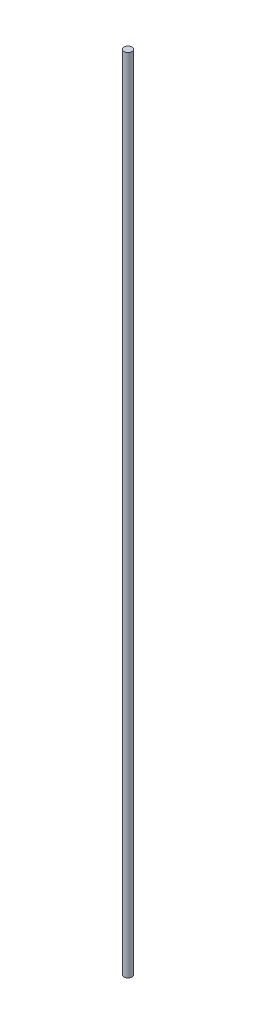
ISO-10303-21;
HEADER;
FILE_DESCRIPTION(('STEP AP214'),'2;1');
FILE_NAME('part.step','',(''),(''),'','','');
FILE_SCHEMA(('AUTOMOTIVE_DESIGN { 1 0 10303 214 1 1 1 1 }'));
ENDSEC;
DATA;
#1=APPLICATION_CONTEXT('core data for automotive mechanical design processes');
#2=APPLICATION_PROTOCOL_DEFINITION('international standard','automotive_design',2000,#1);
#3=PRODUCT_CONTEXT('',#1,'mechanical');
#4=PRODUCT('Part','Part','',(#3));
#5=PRODUCT_RELATED_PRODUCT_CATEGORY('part','',(#4));
#6=PRODUCT_DEFINITION_FORMATION('','',#4);
#7=PRODUCT_DEFINITION_CONTEXT('part definition',#1,'design');
#8=PRODUCT_DEFINITION('design','',#6,#7);
#9=PRODUCT_DEFINITION_SHAPE('','',#8);
#10=(LENGTH_UNIT() NAMED_UNIT(*) SI_UNIT(.MILLI.,.METRE.));
#11=(NAMED_UNIT(*) PLANE_ANGLE_UNIT() SI_UNIT($,.RADIAN.));
#12=(NAMED_UNIT(*) SI_UNIT($,.STERADIAN.) SOLID_ANGLE_UNIT());
#13=UNCERTAINTY_MEASURE_WITH_UNIT(LENGTH_MEASURE(1.E-05),#10,'distance_accuracy_value','');
#14=(GEOMETRIC_REPRESENTATION_CONTEXT(3) GLOBAL_UNCERTAINTY_ASSIGNED_CONTEXT((#13)) GLOBAL_UNIT_ASSIGNED_CONTEXT((#10,
#11,#12)) REPRESENTATION_CONTEXT('',''));
#15=CARTESIAN_POINT('',(0.,0.,0.));
#16=DIRECTION('',(0.,0.,1.));
#17=DIRECTION('',(1.,0.,0.));
#18=AXIS2_PLACEMENT_3D('',#15,#16,#17);
#19=CARTESIAN_POINT('',(0.,200.,0.));
#20=DIRECTION('',(0.,-1.,0.));
#21=DIRECTION('',(0.,0.,-1.));
#22=AXIS2_PLACEMENT_3D('',#19,#20,#21);
#23=CYLINDRICAL_SURFACE('',#22,1.);
#24=CARTESIAN_POINT('',(0.,200.,0.));
#25=DIRECTION('',(0.,1.,0.));
#26=DIRECTION('',(0.,0.,1.));
#27=AXIS2_PLACEMENT_3D('',#24,#25,#26);
#28=CIRCLE('',#27,1.);
#29=CARTESIAN_POINT('',(0.,200.,1.));
#30=VERTEX_POINT('',#29);
#31=EDGE_CURVE('E10',#30,#30,#28,.T.);
#32=ORIENTED_EDGE('',*,*,#31,.F.);
#33=EDGE_LOOP('',(#32));
#34=FACE_BOUND('',#33,.T.);
#35=CARTESIAN_POINT('',(0.,0.,0.));
#36=DIRECTION('',(0.,1.,0.));
#37=DIRECTION('',(0.,0.,1.));
#38=AXIS2_PLACEMENT_3D('',#35,#36,#37);
#39=CIRCLE('',#38,1.);
#40=CARTESIAN_POINT('',(0.,0.,1.));
#41=VERTEX_POINT('',#40);
#42=EDGE_CURVE('E37',#41,#41,#39,.T.);
#43=ORIENTED_EDGE('',*,*,#42,.T.);
#44=EDGE_LOOP('',(#43));
#45=FACE_BOUND('',#44,.T.);
#46=ADVANCED_FACE('F34',(#34,#45),#23,.T.);
#47=CARTESIAN_POINT('',(0.,200.,0.));
#48=DIRECTION('',(0.,1.,0.));
#49=DIRECTION('',(0.,0.,1.));
#50=AXIS2_PLACEMENT_3D('',#47,#48,#49);
#51=PLANE('',#50);
#52=ORIENTED_EDGE('',*,*,#31,.T.);
#53=EDGE_LOOP('',(#52));
#54=FACE_BOUND('',#53,.T.);
#55=ADVANCED_FACE('F49',(#54),#51,.T.);
#56=CARTESIAN_POINT('',(0.,0.,0.));
#57=DIRECTION('',(0.,1.,0.));
#58=DIRECTION('',(0.,0.,1.));
#59=AXIS2_PLACEMENT_3D('',#56,#57,#58);
#60=PLANE('',#59);
#61=ORIENTED_EDGE('',*,*,#42,.F.);
#62=EDGE_LOOP('',(#61));
#63=FACE_BOUND('',#62,.T.);
#64=ADVANCED_FACE('F47',(#63),#60,.F.);
#65=CLOSED_SHELL('',(#46,#55,#64));
#66=MANIFOLD_SOLID_BREP('B2',#65);
#67=ADVANCED_BREP_SHAPE_REPRESENTATION('',(#18,#66),#14);
#68=SHAPE_DEFINITION_REPRESENTATION(#9,#67);
ENDSEC;
END-ISO-10303-21;
